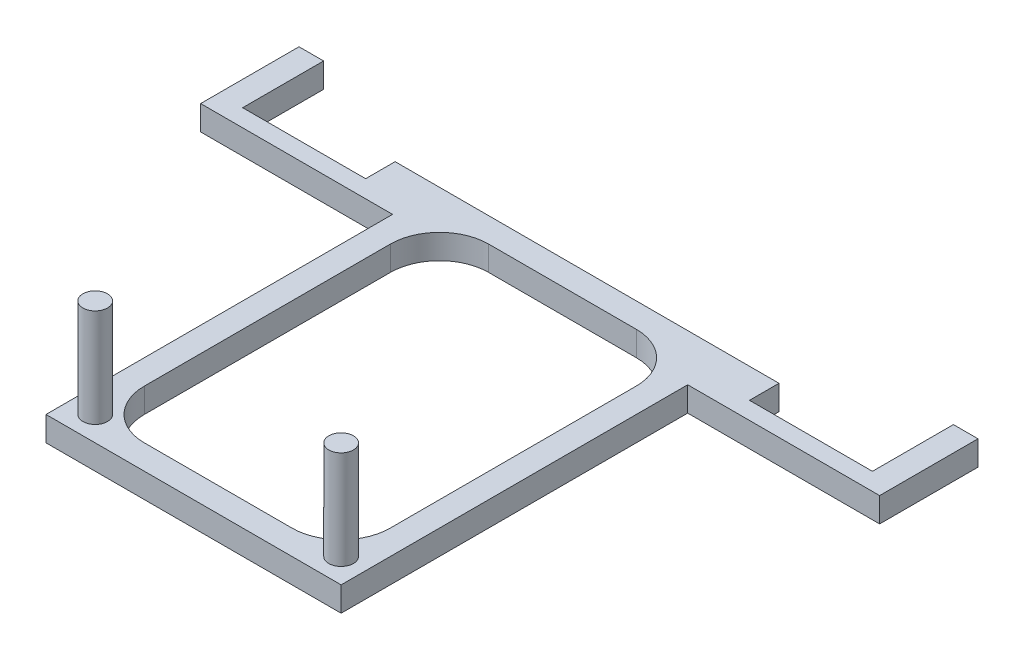
ISO-10303-21;
HEADER;
FILE_DESCRIPTION(('STEP AP214'),'2;1');
FILE_NAME('part.step','',(''),(''),'','','');
FILE_SCHEMA(('AUTOMOTIVE_DESIGN { 1 0 10303 214 1 1 1 1 }'));
ENDSEC;
DATA;
#1=APPLICATION_CONTEXT('core data for automotive mechanical design processes');
#2=APPLICATION_PROTOCOL_DEFINITION('international standard','automotive_design',2000,#1);
#3=PRODUCT_CONTEXT('',#1,'mechanical');
#4=PRODUCT('Part','Part','',(#3));
#5=PRODUCT_RELATED_PRODUCT_CATEGORY('part','',(#4));
#6=PRODUCT_DEFINITION_FORMATION('','',#4);
#7=PRODUCT_DEFINITION_CONTEXT('part definition',#1,'design');
#8=PRODUCT_DEFINITION('design','',#6,#7);
#9=PRODUCT_DEFINITION_SHAPE('','',#8);
#10=(LENGTH_UNIT() NAMED_UNIT(*) SI_UNIT(.MILLI.,.METRE.));
#11=(NAMED_UNIT(*) PLANE_ANGLE_UNIT() SI_UNIT($,.RADIAN.));
#12=(NAMED_UNIT(*) SI_UNIT($,.STERADIAN.) SOLID_ANGLE_UNIT());
#13=UNCERTAINTY_MEASURE_WITH_UNIT(LENGTH_MEASURE(1.E-05),#10,'distance_accuracy_value','');
#14=(GEOMETRIC_REPRESENTATION_CONTEXT(3) GLOBAL_UNCERTAINTY_ASSIGNED_CONTEXT((#13)) GLOBAL_UNIT_ASSIGNED_CONTEXT((#10,
#11,#12)) REPRESENTATION_CONTEXT('',''));
#15=CARTESIAN_POINT('',(0.,0.,0.));
#16=DIRECTION('',(0.,0.,1.));
#17=DIRECTION('',(1.,0.,0.));
#18=AXIS2_PLACEMENT_3D('',#15,#16,#17);
#19=CARTESIAN_POINT('',(0.,1.27,0.));
#20=DIRECTION('',(0.,-1.,0.));
#21=DIRECTION('',(0.,0.,-1.));
#22=AXIS2_PLACEMENT_3D('',#19,#20,#21);
#23=PLANE('',#22);
#24=DIRECTION('',(-1.,0.,0.));
#25=VECTOR('',#24,1.);
#26=CARTESIAN_POINT('',(-9.91107588120617,1.27,-10.16));
#27=LINE('',#26,#25);
#28=CARTESIAN_POINT('',(9.91107588120618,1.27,-10.16));
#29=VERTEX_POINT('',#28);
#30=CARTESIAN_POINT('',(-9.91107588120617,1.27,-10.16));
#31=VERTEX_POINT('',#30);
#32=EDGE_CURVE('E273',#29,#31,#27,.T.);
#33=ORIENTED_EDGE('',*,*,#32,.T.);
#34=DIRECTION('',(0.,0.,1.));
#35=VECTOR('',#34,1.);
#36=CARTESIAN_POINT('',(-9.91107588120617,1.27,-10.16));
#37=LINE('',#36,#35);
#38=CARTESIAN_POINT('',(-9.91107588120617,1.27,-8.636));
#39=VERTEX_POINT('',#38);
#40=EDGE_CURVE('E276',#31,#39,#37,.T.);
#41=ORIENTED_EDGE('',*,*,#40,.T.);
#42=DIRECTION('',(-1.,0.,0.));
#43=VECTOR('',#42,1.);
#44=CARTESIAN_POINT('',(-16.2610758812062,1.27,-8.636));
#45=LINE('',#44,#43);
#46=CARTESIAN_POINT('',(-16.2610758812062,1.27,-8.636));
#47=VERTEX_POINT('',#46);
#48=EDGE_CURVE('E279',#39,#47,#45,.T.);
#49=ORIENTED_EDGE('',*,*,#48,.T.);
#50=DIRECTION('',(0.,0.,-1.));
#51=VECTOR('',#50,1.);
#52=CARTESIAN_POINT('',(-16.2610758812062,1.27,-10.16));
#53=LINE('',#52,#51);
#54=CARTESIAN_POINT('',(-16.2610758812062,1.27,-12.8165032781127));
#55=VERTEX_POINT('',#54);
#56=EDGE_CURVE('E281',#47,#55,#53,.T.);
#57=ORIENTED_EDGE('',*,*,#56,.T.);
#58=DIRECTION('',(-1.,0.,0.));
#59=VECTOR('',#58,1.);
#60=CARTESIAN_POINT('',(-17.5310758812062,1.27,-12.8165032781127));
#61=LINE('',#60,#59);
#62=CARTESIAN_POINT('',(-17.5310758812062,1.27,-12.8165032781127));
#63=VERTEX_POINT('',#62);
#64=EDGE_CURVE('E283',#55,#63,#61,.T.);
#65=ORIENTED_EDGE('',*,*,#64,.T.);
#66=DIRECTION('',(0.,0.,1.));
#67=VECTOR('',#66,1.);
#68=CARTESIAN_POINT('',(-17.5310758812062,1.27,-10.2765032781127));
#69=LINE('',#68,#67);
#70=CARTESIAN_POINT('',(-17.5310758812062,1.27,-7.73650327811265));
#71=VERTEX_POINT('',#70);
#72=EDGE_CURVE('E285',#63,#71,#69,.T.);
#73=ORIENTED_EDGE('',*,*,#72,.T.);
#74=DIRECTION('',(1.,0.,0.));
#75=VECTOR('',#74,1.);
#76=CARTESIAN_POINT('',(-17.5310758812062,1.27,-7.73650327811265));
#77=LINE('',#76,#75);
#78=CARTESIAN_POINT('',(-7.62,1.27,-7.73650327811265));
#79=VERTEX_POINT('',#78);
#80=EDGE_CURVE('E287',#71,#79,#77,.T.);
#81=ORIENTED_EDGE('',*,*,#80,.T.);
#82=DIRECTION('',(0.,0.,1.));
#83=VECTOR('',#82,1.);
#84=CARTESIAN_POINT('',(-7.62,1.27,-7.73650327811265));
#85=LINE('',#84,#83);
#86=CARTESIAN_POINT('',(-7.62,1.27,10.16));
#87=VERTEX_POINT('',#86);
#88=EDGE_CURVE('E289',#79,#87,#85,.T.);
#89=ORIENTED_EDGE('',*,*,#88,.T.);
#90=DIRECTION('',(1.,0.,0.));
#91=VECTOR('',#90,1.);
#92=CARTESIAN_POINT('',(7.62,1.27,10.16));
#93=LINE('',#92,#91);
#94=CARTESIAN_POINT('',(7.62,1.27,10.16));
#95=VERTEX_POINT('',#94);
#96=EDGE_CURVE('E291',#87,#95,#93,.T.);
#97=ORIENTED_EDGE('',*,*,#96,.T.);
#98=DIRECTION('',(0.,0.,-1.));
#99=VECTOR('',#98,1.);
#100=CARTESIAN_POINT('',(7.62000000000001,1.27,-7.73650327811265));
#101=LINE('',#100,#99);
#102=CARTESIAN_POINT('',(7.62000000000001,1.27,-7.73650327811265));
#103=VERTEX_POINT('',#102);
#104=EDGE_CURVE('E293',#95,#103,#101,.T.);
#105=ORIENTED_EDGE('',*,*,#104,.T.);
#106=DIRECTION('',(1.,0.,0.));
#107=VECTOR('',#106,1.);
#108=CARTESIAN_POINT('',(17.5310758812062,1.27,-7.73650327811265));
#109=LINE('',#108,#107);
#110=CARTESIAN_POINT('',(17.5310758812062,1.27,-7.73650327811265));
#111=VERTEX_POINT('',#110);
#112=EDGE_CURVE('E295',#103,#111,#109,.T.);
#113=ORIENTED_EDGE('',*,*,#112,.T.);
#114=DIRECTION('',(0.,0.,-1.));
#115=VECTOR('',#114,1.);
#116=CARTESIAN_POINT('',(17.5310758812062,1.27,-10.2765032781127));
#117=LINE('',#116,#115);
#118=CARTESIAN_POINT('',(17.5310758812062,1.27,-12.8165032781127));
#119=VERTEX_POINT('',#118);
#120=EDGE_CURVE('E297',#111,#119,#117,.T.);
#121=ORIENTED_EDGE('',*,*,#120,.T.);
#122=DIRECTION('',(-1.,0.,0.));
#123=VECTOR('',#122,1.);
#124=CARTESIAN_POINT('',(17.5310758812062,1.27,-12.8165032781127));
#125=LINE('',#124,#123);
#126=CARTESIAN_POINT('',(16.2610758812062,1.27,-12.8165032781127));
#127=VERTEX_POINT('',#126);
#128=EDGE_CURVE('E299',#119,#127,#125,.T.);
#129=ORIENTED_EDGE('',*,*,#128,.T.);
#130=DIRECTION('',(0.,0.,1.));
#131=VECTOR('',#130,1.);
#132=CARTESIAN_POINT('',(16.2610758812062,1.27,-12.8165032781127));
#133=LINE('',#132,#131);
#134=CARTESIAN_POINT('',(16.2610758812062,1.27,-8.636));
#135=VERTEX_POINT('',#134);
#136=EDGE_CURVE('E301',#127,#135,#133,.T.);
#137=ORIENTED_EDGE('',*,*,#136,.T.);
#138=DIRECTION('',(-1.,0.,0.));
#139=VECTOR('',#138,1.);
#140=CARTESIAN_POINT('',(16.2610758812062,1.27,-8.636));
#141=LINE('',#140,#139);
#142=CARTESIAN_POINT('',(9.91107588120618,1.27,-8.636));
#143=VERTEX_POINT('',#142);
#144=EDGE_CURVE('E303',#135,#143,#141,.T.);
#145=ORIENTED_EDGE('',*,*,#144,.T.);
#146=DIRECTION('',(0.,0.,-1.));
#147=VECTOR('',#146,1.);
#148=CARTESIAN_POINT('',(9.91107588120618,1.27,-10.16));
#149=LINE('',#148,#147);
#150=EDGE_CURVE('E305',#143,#29,#149,.T.);
#151=ORIENTED_EDGE('',*,*,#150,.T.);
#152=EDGE_LOOP('',(#33,#41,#49,#57,#65,#73,#81,#89,#97,#105,#113,#121,#129,#137,#145,#151));
#153=FACE_BOUND('',#152,.T.);
#154=CARTESIAN_POINT('',(-6.35,1.27,8.89));
#155=DIRECTION('',(0.,-1.,0.));
#156=DIRECTION('',(0.,0.,-1.));
#157=AXIS2_PLACEMENT_3D('',#154,#155,#156);
#158=CIRCLE('',#157,0.635000000000001);
#159=CARTESIAN_POINT('',(-6.35,1.27,8.255));
#160=VERTEX_POINT('',#159);
#161=EDGE_CURVE('E266',#160,#160,#158,.F.);
#162=ORIENTED_EDGE('',*,*,#161,.F.);
#163=EDGE_LOOP('',(#162));
#164=FACE_BOUND('',#163,.T.);
#165=CARTESIAN_POINT('',(6.35,1.27,8.89));
#166=DIRECTION('',(0.,-1.,0.));
#167=DIRECTION('',(0.,0.,-1.));
#168=AXIS2_PLACEMENT_3D('',#165,#166,#167);
#169=CIRCLE('',#168,0.635000000000001);
#170=CARTESIAN_POINT('',(6.35,1.27,8.255));
#171=VERTEX_POINT('',#170);
#172=EDGE_CURVE('E201',#171,#171,#169,.F.);
#173=ORIENTED_EDGE('',*,*,#172,.F.);
#174=EDGE_LOOP('',(#173));
#175=FACE_BOUND('',#174,.T.);
#176=CARTESIAN_POINT('',(-3.81,1.27,6.35));
#177=DIRECTION('',(0.,-1.,0.));
#178=DIRECTION('',(0.,0.,-1.));
#179=AXIS2_PLACEMENT_3D('',#176,#177,#178);
#180=CIRCLE('',#179,2.54);
#181=CARTESIAN_POINT('',(-6.35,1.27,6.34999999999998));
#182=VERTEX_POINT('',#181);
#183=CARTESIAN_POINT('',(-3.80999999999998,1.27,8.89));
#184=VERTEX_POINT('',#183);
#185=EDGE_CURVE('E240',#182,#184,#180,.F.);
#186=ORIENTED_EDGE('',*,*,#185,.F.);
#187=DIRECTION('',(0.,0.,1.));
#188=VECTOR('',#187,1.);
#189=CARTESIAN_POINT('',(-6.35,1.27,0.));
#190=LINE('',#189,#188);
#191=CARTESIAN_POINT('',(-6.35,1.27,-6.34999999999998));
#192=VERTEX_POINT('',#191);
#193=EDGE_CURVE('E241',#192,#182,#190,.T.);
#194=ORIENTED_EDGE('',*,*,#193,.F.);
#195=CARTESIAN_POINT('',(-3.81,1.27,-6.35));
#196=DIRECTION('',(0.,-1.,0.));
#197=DIRECTION('',(0.,0.,-1.));
#198=AXIS2_PLACEMENT_3D('',#195,#196,#197);
#199=CIRCLE('',#198,2.54);
#200=CARTESIAN_POINT('',(-3.80999999999998,1.27,-8.89));
#201=VERTEX_POINT('',#200);
#202=EDGE_CURVE('E208',#201,#192,#199,.F.);
#203=ORIENTED_EDGE('',*,*,#202,.F.);
#204=DIRECTION('',(-1.,0.,0.));
#205=VECTOR('',#204,1.);
#206=CARTESIAN_POINT('',(0.,1.27,-8.89));
#207=LINE('',#206,#205);
#208=CARTESIAN_POINT('',(3.80999999999998,1.27,-8.89));
#209=VERTEX_POINT('',#208);
#210=EDGE_CURVE('E249',#209,#201,#207,.T.);
#211=ORIENTED_EDGE('',*,*,#210,.F.);
#212=CARTESIAN_POINT('',(3.81,1.27,-6.35));
#213=DIRECTION('',(0.,-1.,0.));
#214=DIRECTION('',(0.,0.,-1.));
#215=AXIS2_PLACEMENT_3D('',#212,#213,#214);
#216=CIRCLE('',#215,2.54);
#217=CARTESIAN_POINT('',(6.35,1.27,-6.34999999999998));
#218=VERTEX_POINT('',#217);
#219=EDGE_CURVE('E251',#218,#209,#216,.F.);
#220=ORIENTED_EDGE('',*,*,#219,.F.);
#221=DIRECTION('',(0.,0.,-1.));
#222=VECTOR('',#221,1.);
#223=CARTESIAN_POINT('',(6.35,1.27,0.));
#224=LINE('',#223,#222);
#225=CARTESIAN_POINT('',(6.35,1.27,6.34999999999998));
#226=VERTEX_POINT('',#225);
#227=EDGE_CURVE('E253',#226,#218,#224,.T.);
#228=ORIENTED_EDGE('',*,*,#227,.F.);
#229=CARTESIAN_POINT('',(3.81,1.27,6.35));
#230=DIRECTION('',(0.,-1.,0.));
#231=DIRECTION('',(0.,0.,-1.));
#232=AXIS2_PLACEMENT_3D('',#229,#230,#231);
#233=CIRCLE('',#232,2.54);
#234=CARTESIAN_POINT('',(3.80999999999998,1.27,8.89));
#235=VERTEX_POINT('',#234);
#236=EDGE_CURVE('E255',#235,#226,#233,.F.);
#237=ORIENTED_EDGE('',*,*,#236,.F.);
#238=DIRECTION('',(1.,0.,0.));
#239=VECTOR('',#238,1.);
#240=CARTESIAN_POINT('',(0.,1.27,8.89));
#241=LINE('',#240,#239);
#242=EDGE_CURVE('E257',#184,#235,#241,.T.);
#243=ORIENTED_EDGE('',*,*,#242,.F.);
#244=EDGE_LOOP('',(#186,#194,#203,#211,#220,#228,#237,#243));
#245=FACE_BOUND('',#244,.T.);
#246=ADVANCED_FACE('F38',(#153,#164,#175,#245),#23,.F.);
#247=CARTESIAN_POINT('',(0.,0.,0.));
#248=DIRECTION('',(0.,-1.,0.));
#249=DIRECTION('',(0.,0.,-1.));
#250=AXIS2_PLACEMENT_3D('',#247,#248,#249);
#251=PLANE('',#250);
#252=DIRECTION('',(0.,0.,1.));
#253=VECTOR('',#252,1.);
#254=CARTESIAN_POINT('',(-9.91107588120617,0.,-10.16));
#255=LINE('',#254,#253);
#256=CARTESIAN_POINT('',(-9.91107588120617,0.,-10.16));
#257=VERTEX_POINT('',#256);
#258=CARTESIAN_POINT('',(-9.91107588120617,0.,-8.636));
#259=VERTEX_POINT('',#258);
#260=EDGE_CURVE('E269',#257,#259,#255,.T.);
#261=ORIENTED_EDGE('',*,*,#260,.F.);
#262=DIRECTION('',(-1.,0.,0.));
#263=VECTOR('',#262,1.);
#264=CARTESIAN_POINT('',(7.62,0.,-10.16));
#265=LINE('',#264,#263);
#266=CARTESIAN_POINT('',(9.91107588120618,0.,-10.16));
#267=VERTEX_POINT('',#266);
#268=EDGE_CURVE('E277',#267,#257,#265,.T.);
#269=ORIENTED_EDGE('',*,*,#268,.F.);
#270=DIRECTION('',(0.,0.,-1.));
#271=VECTOR('',#270,1.);
#272=CARTESIAN_POINT('',(9.91107588120618,0.,-10.16));
#273=LINE('',#272,#271);
#274=CARTESIAN_POINT('',(9.91107588120618,0.,-8.636));
#275=VERTEX_POINT('',#274);
#276=EDGE_CURVE('E340',#275,#267,#273,.T.);
#277=ORIENTED_EDGE('',*,*,#276,.F.);
#278=DIRECTION('',(-1.,0.,0.));
#279=VECTOR('',#278,1.);
#280=CARTESIAN_POINT('',(16.2610758812062,0.,-8.636));
#281=LINE('',#280,#279);
#282=CARTESIAN_POINT('',(16.2610758812062,0.,-8.636));
#283=VERTEX_POINT('',#282);
#284=EDGE_CURVE('E338',#283,#275,#281,.T.);
#285=ORIENTED_EDGE('',*,*,#284,.F.);
#286=DIRECTION('',(0.,0.,1.));
#287=VECTOR('',#286,1.);
#288=CARTESIAN_POINT('',(16.2610758812062,0.,-10.16));
#289=LINE('',#288,#287);
#290=CARTESIAN_POINT('',(16.2610758812062,0.,-12.8165032781127));
#291=VERTEX_POINT('',#290);
#292=EDGE_CURVE('E336',#291,#283,#289,.T.);
#293=ORIENTED_EDGE('',*,*,#292,.F.);
#294=DIRECTION('',(-1.,0.,0.));
#295=VECTOR('',#294,1.);
#296=CARTESIAN_POINT('',(17.5310758812062,0.,-12.8165032781127));
#297=LINE('',#296,#295);
#298=CARTESIAN_POINT('',(17.5310758812062,0.,-12.8165032781127));
#299=VERTEX_POINT('',#298);
#300=EDGE_CURVE('E333',#299,#291,#297,.T.);
#301=ORIENTED_EDGE('',*,*,#300,.F.);
#302=DIRECTION('',(0.,0.,-1.));
#303=VECTOR('',#302,1.);
#304=CARTESIAN_POINT('',(17.5310758812062,0.,-10.2765032781127));
#305=LINE('',#304,#303);
#306=CARTESIAN_POINT('',(17.5310758812062,0.,-7.73650327811265));
#307=VERTEX_POINT('',#306);
#308=EDGE_CURVE('E331',#307,#299,#305,.T.);
#309=ORIENTED_EDGE('',*,*,#308,.F.);
#310=DIRECTION('',(1.,0.,0.));
#311=VECTOR('',#310,1.);
#312=CARTESIAN_POINT('',(17.5310758812062,0.,-7.73650327811265));
#313=LINE('',#312,#311);
#314=CARTESIAN_POINT('',(7.62000000000001,0.,-7.73650327811265));
#315=VERTEX_POINT('',#314);
#316=EDGE_CURVE('E328',#315,#307,#313,.T.);
#317=ORIENTED_EDGE('',*,*,#316,.F.);
#318=DIRECTION('',(0.,0.,-1.));
#319=VECTOR('',#318,1.);
#320=CARTESIAN_POINT('',(7.62000000000001,0.,-7.73650327811265));
#321=LINE('',#320,#319);
#322=CARTESIAN_POINT('',(7.62,0.,10.16));
#323=VERTEX_POINT('',#322);
#324=EDGE_CURVE('E326',#323,#315,#321,.T.);
#325=ORIENTED_EDGE('',*,*,#324,.F.);
#326=DIRECTION('',(1.,0.,0.));
#327=VECTOR('',#326,1.);
#328=CARTESIAN_POINT('',(7.62,0.,10.16));
#329=LINE('',#328,#327);
#330=CARTESIAN_POINT('',(-7.62,0.,10.16));
#331=VERTEX_POINT('',#330);
#332=EDGE_CURVE('E324',#331,#323,#329,.T.);
#333=ORIENTED_EDGE('',*,*,#332,.F.);
#334=DIRECTION('',(0.,0.,1.));
#335=VECTOR('',#334,1.);
#336=CARTESIAN_POINT('',(-7.62,0.,-7.73650327811265));
#337=LINE('',#336,#335);
#338=CARTESIAN_POINT('',(-7.62,0.,-7.73650327811265));
#339=VERTEX_POINT('',#338);
#340=EDGE_CURVE('E322',#339,#331,#337,.T.);
#341=ORIENTED_EDGE('',*,*,#340,.F.);
#342=DIRECTION('',(1.,0.,0.));
#343=VECTOR('',#342,1.);
#344=CARTESIAN_POINT('',(-17.5310758812062,0.,-7.73650327811265));
#345=LINE('',#344,#343);
#346=CARTESIAN_POINT('',(-17.5310758812062,0.,-7.73650327811265));
#347=VERTEX_POINT('',#346);
#348=EDGE_CURVE('E320',#347,#339,#345,.T.);
#349=ORIENTED_EDGE('',*,*,#348,.F.);
#350=DIRECTION('',(0.,0.,1.));
#351=VECTOR('',#350,1.);
#352=CARTESIAN_POINT('',(-17.5310758812062,0.,-10.2765032781127));
#353=LINE('',#352,#351);
#354=CARTESIAN_POINT('',(-17.5310758812062,0.,-12.8165032781127));
#355=VERTEX_POINT('',#354);
#356=EDGE_CURVE('E318',#355,#347,#353,.T.);
#357=ORIENTED_EDGE('',*,*,#356,.F.);
#358=DIRECTION('',(-1.,0.,0.));
#359=VECTOR('',#358,1.);
#360=CARTESIAN_POINT('',(-17.5310758812062,0.,-12.8165032781127));
#361=LINE('',#360,#359);
#362=CARTESIAN_POINT('',(-16.2610758812062,0.,-12.8165032781127));
#363=VERTEX_POINT('',#362);
#364=EDGE_CURVE('E315',#363,#355,#361,.T.);
#365=ORIENTED_EDGE('',*,*,#364,.F.);
#366=DIRECTION('',(0.,0.,-1.));
#367=VECTOR('',#366,1.);
#368=CARTESIAN_POINT('',(-16.2610758812062,0.,-12.8165032781127));
#369=LINE('',#368,#367);
#370=CARTESIAN_POINT('',(-16.2610758812062,0.,-8.636));
#371=VERTEX_POINT('',#370);
#372=EDGE_CURVE('E313',#371,#363,#369,.T.);
#373=ORIENTED_EDGE('',*,*,#372,.F.);
#374=DIRECTION('',(-1.,0.,0.));
#375=VECTOR('',#374,1.);
#376=CARTESIAN_POINT('',(-16.2610758812062,0.,-8.636));
#377=LINE('',#376,#375);
#378=EDGE_CURVE('E310',#259,#371,#377,.T.);
#379=ORIENTED_EDGE('',*,*,#378,.F.);
#380=EDGE_LOOP('',(#261,#269,#277,#285,#293,#301,#309,#317,#325,#333,#341,#349,#357,#365,#373,#379));
#381=FACE_BOUND('',#380,.T.);
#382=DIRECTION('',(0.,0.,1.));
#383=VECTOR('',#382,1.);
#384=CARTESIAN_POINT('',(-6.35,0.,0.));
#385=LINE('',#384,#383);
#386=CARTESIAN_POINT('',(-6.35,0.,-6.34999999999998));
#387=VERTEX_POINT('',#386);
#388=CARTESIAN_POINT('',(-6.35,0.,6.34999999999998));
#389=VERTEX_POINT('',#388);
#390=EDGE_CURVE('E196',#387,#389,#385,.T.);
#391=ORIENTED_EDGE('',*,*,#390,.T.);
#392=CARTESIAN_POINT('',(-3.81,0.,6.35));
#393=DIRECTION('',(0.,-1.,0.));
#394=DIRECTION('',(0.,0.,-1.));
#395=AXIS2_PLACEMENT_3D('',#392,#393,#394);
#396=CIRCLE('',#395,2.54);
#397=CARTESIAN_POINT('',(-3.80999999999998,0.,8.89));
#398=VERTEX_POINT('',#397);
#399=EDGE_CURVE('E11',#389,#398,#396,.F.);
#400=ORIENTED_EDGE('',*,*,#399,.T.);
#401=DIRECTION('',(1.,0.,0.));
#402=VECTOR('',#401,1.);
#403=CARTESIAN_POINT('',(0.,0.,8.89));
#404=LINE('',#403,#402);
#405=CARTESIAN_POINT('',(3.80999999999998,0.,8.89));
#406=VERTEX_POINT('',#405);
#407=EDGE_CURVE('E46',#398,#406,#404,.T.);
#408=ORIENTED_EDGE('',*,*,#407,.T.);
#409=CARTESIAN_POINT('',(3.81,0.,6.35));
#410=DIRECTION('',(0.,-1.,0.));
#411=DIRECTION('',(0.,0.,-1.));
#412=AXIS2_PLACEMENT_3D('',#409,#410,#411);
#413=CIRCLE('',#412,2.54);
#414=CARTESIAN_POINT('',(6.35,0.,6.34999999999998));
#415=VERTEX_POINT('',#414);
#416=EDGE_CURVE('E225',#406,#415,#413,.F.);
#417=ORIENTED_EDGE('',*,*,#416,.T.);
#418=DIRECTION('',(0.,0.,-1.));
#419=VECTOR('',#418,1.);
#420=CARTESIAN_POINT('',(6.35,0.,0.));
#421=LINE('',#420,#419);
#422=CARTESIAN_POINT('',(6.35,0.,-6.34999999999998));
#423=VERTEX_POINT('',#422);
#424=EDGE_CURVE('E222',#415,#423,#421,.T.);
#425=ORIENTED_EDGE('',*,*,#424,.T.);
#426=CARTESIAN_POINT('',(3.81,0.,-6.35));
#427=DIRECTION('',(0.,-1.,0.));
#428=DIRECTION('',(0.,0.,-1.));
#429=AXIS2_PLACEMENT_3D('',#426,#427,#428);
#430=CIRCLE('',#429,2.54);
#431=CARTESIAN_POINT('',(3.80999999999998,0.,-8.89));
#432=VERTEX_POINT('',#431);
#433=EDGE_CURVE('E217',#423,#432,#430,.F.);
#434=ORIENTED_EDGE('',*,*,#433,.T.);
#435=DIRECTION('',(-1.,0.,0.));
#436=VECTOR('',#435,1.);
#437=CARTESIAN_POINT('',(0.,0.,-8.89));
#438=LINE('',#437,#436);
#439=CARTESIAN_POINT('',(-3.80999999999998,0.,-8.89));
#440=VERTEX_POINT('',#439);
#441=EDGE_CURVE('E215',#432,#440,#438,.T.);
#442=ORIENTED_EDGE('',*,*,#441,.T.);
#443=CARTESIAN_POINT('',(-3.81,0.,-6.35));
#444=DIRECTION('',(0.,-1.,0.));
#445=DIRECTION('',(0.,0.,-1.));
#446=AXIS2_PLACEMENT_3D('',#443,#444,#445);
#447=CIRCLE('',#446,2.54);
#448=EDGE_CURVE('E200',#440,#387,#447,.F.);
#449=ORIENTED_EDGE('',*,*,#448,.T.);
#450=EDGE_LOOP('',(#391,#400,#408,#417,#425,#434,#442,#449));
#451=FACE_BOUND('',#450,.T.);
#452=ADVANCED_FACE('F213',(#381,#451),#251,.T.);
#453=CARTESIAN_POINT('',(-9.91107588120617,1.27,-10.16));
#454=DIRECTION('',(1.,0.,0.));
#455=DIRECTION('',(0.,0.,-1.));
#456=AXIS2_PLACEMENT_3D('',#453,#454,#455);
#457=PLANE('',#456);
#458=ORIENTED_EDGE('',*,*,#260,.T.);
#459=DIRECTION('',(0.,-1.,0.));
#460=VECTOR('',#459,1.);
#461=CARTESIAN_POINT('',(-9.91107588120617,1.27,-8.636));
#462=LINE('',#461,#460);
#463=EDGE_CURVE('E385',#39,#259,#462,.T.);
#464=ORIENTED_EDGE('',*,*,#463,.F.);
#465=ORIENTED_EDGE('',*,*,#40,.F.);
#466=DIRECTION('',(0.,-1.,0.));
#467=VECTOR('',#466,1.);
#468=CARTESIAN_POINT('',(-9.91107588120617,1.27,-10.16));
#469=LINE('',#468,#467);
#470=EDGE_CURVE('E272',#31,#257,#469,.T.);
#471=ORIENTED_EDGE('',*,*,#470,.T.);
#472=EDGE_LOOP('',(#458,#464,#465,#471));
#473=FACE_BOUND('',#472,.T.);
#474=ADVANCED_FACE('F40',(#473),#457,.F.);
#475=CARTESIAN_POINT('',(-16.2610758812062,1.27,-8.636));
#476=DIRECTION('',(0.,0.,1.));
#477=DIRECTION('',(1.,0.,0.));
#478=AXIS2_PLACEMENT_3D('',#475,#476,#477);
#479=PLANE('',#478);
#480=ORIENTED_EDGE('',*,*,#378,.T.);
#481=DIRECTION('',(0.,-1.,0.));
#482=VECTOR('',#481,1.);
#483=CARTESIAN_POINT('',(-16.2610758812062,1.27,-8.636));
#484=LINE('',#483,#482);
#485=EDGE_CURVE('E382',#47,#371,#484,.T.);
#486=ORIENTED_EDGE('',*,*,#485,.F.);
#487=ORIENTED_EDGE('',*,*,#48,.F.);
#488=ORIENTED_EDGE('',*,*,#463,.T.);
#489=EDGE_LOOP('',(#480,#486,#487,#488));
#490=FACE_BOUND('',#489,.T.);
#491=ADVANCED_FACE('F401',(#490),#479,.F.);
#492=CARTESIAN_POINT('',(-16.2610758812062,1.27,-12.8165032781127));
#493=DIRECTION('',(-1.,0.,0.));
#494=DIRECTION('',(0.,0.,1.));
#495=AXIS2_PLACEMENT_3D('',#492,#493,#494);
#496=PLANE('',#495);
#497=ORIENTED_EDGE('',*,*,#372,.T.);
#498=DIRECTION('',(0.,-1.,0.));
#499=VECTOR('',#498,1.);
#500=CARTESIAN_POINT('',(-16.2610758812062,1.27,-12.8165032781127));
#501=LINE('',#500,#499);
#502=EDGE_CURVE('E379',#55,#363,#501,.T.);
#503=ORIENTED_EDGE('',*,*,#502,.F.);
#504=ORIENTED_EDGE('',*,*,#56,.F.);
#505=ORIENTED_EDGE('',*,*,#485,.T.);
#506=EDGE_LOOP('',(#497,#503,#504,#505));
#507=FACE_BOUND('',#506,.T.);
#508=ADVANCED_FACE('F405',(#507),#496,.F.);
#509=CARTESIAN_POINT('',(-17.5310758812062,1.27,-12.8165032781127));
#510=DIRECTION('',(0.,0.,1.));
#511=DIRECTION('',(1.,0.,0.));
#512=AXIS2_PLACEMENT_3D('',#509,#510,#511);
#513=PLANE('',#512);
#514=ORIENTED_EDGE('',*,*,#364,.T.);
#515=DIRECTION('',(0.,-1.,0.));
#516=VECTOR('',#515,1.);
#517=CARTESIAN_POINT('',(-17.5310758812062,1.27,-12.8165032781127));
#518=LINE('',#517,#516);
#519=EDGE_CURVE('E376',#63,#355,#518,.T.);
#520=ORIENTED_EDGE('',*,*,#519,.F.);
#521=ORIENTED_EDGE('',*,*,#64,.F.);
#522=ORIENTED_EDGE('',*,*,#502,.T.);
#523=EDGE_LOOP('',(#514,#520,#521,#522));
#524=FACE_BOUND('',#523,.T.);
#525=ADVANCED_FACE('F460',(#524),#513,.F.);
#526=CARTESIAN_POINT('',(-17.5310758812062,1.27,-10.2765032781127));
#527=DIRECTION('',(1.,0.,0.));
#528=DIRECTION('',(0.,0.,-1.));
#529=AXIS2_PLACEMENT_3D('',#526,#527,#528);
#530=PLANE('',#529);
#531=ORIENTED_EDGE('',*,*,#356,.T.);
#532=DIRECTION('',(0.,-1.,0.));
#533=VECTOR('',#532,1.);
#534=CARTESIAN_POINT('',(-17.5310758812062,1.27,-7.73650327811265));
#535=LINE('',#534,#533);
#536=EDGE_CURVE('E373',#71,#347,#535,.T.);
#537=ORIENTED_EDGE('',*,*,#536,.F.);
#538=ORIENTED_EDGE('',*,*,#72,.F.);
#539=ORIENTED_EDGE('',*,*,#519,.T.);
#540=EDGE_LOOP('',(#531,#537,#538,#539));
#541=FACE_BOUND('',#540,.T.);
#542=ADVANCED_FACE('F462',(#541),#530,.F.);
#543=CARTESIAN_POINT('',(-17.5310758812062,1.27,-7.73650327811265));
#544=DIRECTION('',(0.,0.,-1.));
#545=DIRECTION('',(-1.,0.,0.));
#546=AXIS2_PLACEMENT_3D('',#543,#544,#545);
#547=PLANE('',#546);
#548=ORIENTED_EDGE('',*,*,#348,.T.);
#549=DIRECTION('',(0.,-1.,0.));
#550=VECTOR('',#549,1.);
#551=CARTESIAN_POINT('',(-7.62,1.27,-7.73650327811265));
#552=LINE('',#551,#550);
#553=EDGE_CURVE('E370',#79,#339,#552,.T.);
#554=ORIENTED_EDGE('',*,*,#553,.F.);
#555=ORIENTED_EDGE('',*,*,#80,.F.);
#556=ORIENTED_EDGE('',*,*,#536,.T.);
#557=EDGE_LOOP('',(#548,#554,#555,#556));
#558=FACE_BOUND('',#557,.T.);
#559=ADVANCED_FACE('F456',(#558),#547,.F.);
#560=CARTESIAN_POINT('',(-7.62,1.27,-7.73650327811265));
#561=DIRECTION('',(1.,0.,0.));
#562=DIRECTION('',(0.,0.,-1.));
#563=AXIS2_PLACEMENT_3D('',#560,#561,#562);
#564=PLANE('',#563);
#565=ORIENTED_EDGE('',*,*,#340,.T.);
#566=DIRECTION('',(0.,-1.,0.));
#567=VECTOR('',#566,1.);
#568=CARTESIAN_POINT('',(-7.62,1.27,10.16));
#569=LINE('',#568,#567);
#570=EDGE_CURVE('E367',#87,#331,#569,.T.);
#571=ORIENTED_EDGE('',*,*,#570,.F.);
#572=ORIENTED_EDGE('',*,*,#88,.F.);
#573=ORIENTED_EDGE('',*,*,#553,.T.);
#574=EDGE_LOOP('',(#565,#571,#572,#573));
#575=FACE_BOUND('',#574,.T.);
#576=ADVANCED_FACE('F452',(#575),#564,.F.);
#577=CARTESIAN_POINT('',(7.62,1.27,10.16));
#578=DIRECTION('',(0.,0.,-1.));
#579=DIRECTION('',(-1.,0.,0.));
#580=AXIS2_PLACEMENT_3D('',#577,#578,#579);
#581=PLANE('',#580);
#582=ORIENTED_EDGE('',*,*,#332,.T.);
#583=DIRECTION('',(0.,-1.,0.));
#584=VECTOR('',#583,1.);
#585=CARTESIAN_POINT('',(7.62,1.27,10.16));
#586=LINE('',#585,#584);
#587=EDGE_CURVE('E364',#95,#323,#586,.T.);
#588=ORIENTED_EDGE('',*,*,#587,.F.);
#589=ORIENTED_EDGE('',*,*,#96,.F.);
#590=ORIENTED_EDGE('',*,*,#570,.T.);
#591=EDGE_LOOP('',(#582,#588,#589,#590));
#592=FACE_BOUND('',#591,.T.);
#593=ADVANCED_FACE('F448',(#592),#581,.F.);
#594=CARTESIAN_POINT('',(7.62000000000001,1.27,-7.73650327811265));
#595=DIRECTION('',(-1.,0.,0.));
#596=DIRECTION('',(0.,0.,1.));
#597=AXIS2_PLACEMENT_3D('',#594,#595,#596);
#598=PLANE('',#597);
#599=ORIENTED_EDGE('',*,*,#324,.T.);
#600=DIRECTION('',(0.,-1.,0.));
#601=VECTOR('',#600,1.);
#602=CARTESIAN_POINT('',(7.62000000000001,1.27,-7.73650327811265));
#603=LINE('',#602,#601);
#604=EDGE_CURVE('E361',#103,#315,#603,.T.);
#605=ORIENTED_EDGE('',*,*,#604,.F.);
#606=ORIENTED_EDGE('',*,*,#104,.F.);
#607=ORIENTED_EDGE('',*,*,#587,.T.);
#608=EDGE_LOOP('',(#599,#605,#606,#607));
#609=FACE_BOUND('',#608,.T.);
#610=ADVANCED_FACE('F443',(#609),#598,.F.);
#611=CARTESIAN_POINT('',(17.5310758812062,1.27,-7.73650327811265));
#612=DIRECTION('',(0.,0.,-1.));
#613=DIRECTION('',(-1.,0.,0.));
#614=AXIS2_PLACEMENT_3D('',#611,#612,#613);
#615=PLANE('',#614);
#616=ORIENTED_EDGE('',*,*,#316,.T.);
#617=DIRECTION('',(0.,-1.,0.));
#618=VECTOR('',#617,1.);
#619=CARTESIAN_POINT('',(17.5310758812062,1.27,-7.73650327811265));
#620=LINE('',#619,#618);
#621=EDGE_CURVE('E358',#111,#307,#620,.T.);
#622=ORIENTED_EDGE('',*,*,#621,.F.);
#623=ORIENTED_EDGE('',*,*,#112,.F.);
#624=ORIENTED_EDGE('',*,*,#604,.T.);
#625=EDGE_LOOP('',(#616,#622,#623,#624));
#626=FACE_BOUND('',#625,.T.);
#627=ADVANCED_FACE('F434',(#626),#615,.F.);
#628=CARTESIAN_POINT('',(17.5310758812062,1.27,-10.2765032781127));
#629=DIRECTION('',(-1.,0.,0.));
#630=DIRECTION('',(0.,0.,1.));
#631=AXIS2_PLACEMENT_3D('',#628,#629,#630);
#632=PLANE('',#631);
#633=ORIENTED_EDGE('',*,*,#308,.T.);
#634=DIRECTION('',(0.,-1.,0.));
#635=VECTOR('',#634,1.);
#636=CARTESIAN_POINT('',(17.5310758812062,1.27,-12.8165032781127));
#637=LINE('',#636,#635);
#638=EDGE_CURVE('E355',#119,#299,#637,.T.);
#639=ORIENTED_EDGE('',*,*,#638,.F.);
#640=ORIENTED_EDGE('',*,*,#120,.F.);
#641=ORIENTED_EDGE('',*,*,#621,.T.);
#642=EDGE_LOOP('',(#633,#639,#640,#641));
#643=FACE_BOUND('',#642,.T.);
#644=ADVANCED_FACE('F438',(#643),#632,.F.);
#645=CARTESIAN_POINT('',(17.5310758812062,1.27,-12.8165032781127));
#646=DIRECTION('',(0.,0.,1.));
#647=DIRECTION('',(1.,0.,0.));
#648=AXIS2_PLACEMENT_3D('',#645,#646,#647);
#649=PLANE('',#648);
#650=ORIENTED_EDGE('',*,*,#300,.T.);
#651=DIRECTION('',(0.,-1.,0.));
#652=VECTOR('',#651,1.);
#653=CARTESIAN_POINT('',(16.2610758812062,1.27,-12.8165032781127));
#654=LINE('',#653,#652);
#655=EDGE_CURVE('E352',#127,#291,#654,.T.);
#656=ORIENTED_EDGE('',*,*,#655,.F.);
#657=ORIENTED_EDGE('',*,*,#128,.F.);
#658=ORIENTED_EDGE('',*,*,#638,.T.);
#659=EDGE_LOOP('',(#650,#656,#657,#658));
#660=FACE_BOUND('',#659,.T.);
#661=ADVANCED_FACE('F427',(#660),#649,.F.);
#662=CARTESIAN_POINT('',(16.2610758812062,1.27,-10.16));
#663=DIRECTION('',(1.,0.,0.));
#664=DIRECTION('',(0.,0.,-1.));
#665=AXIS2_PLACEMENT_3D('',#662,#663,#664);
#666=PLANE('',#665);
#667=ORIENTED_EDGE('',*,*,#292,.T.);
#668=DIRECTION('',(0.,-1.,0.));
#669=VECTOR('',#668,1.);
#670=CARTESIAN_POINT('',(16.2610758812062,1.27,-8.636));
#671=LINE('',#670,#669);
#672=EDGE_CURVE('E349',#135,#283,#671,.T.);
#673=ORIENTED_EDGE('',*,*,#672,.F.);
#674=ORIENTED_EDGE('',*,*,#136,.F.);
#675=ORIENTED_EDGE('',*,*,#655,.T.);
#676=EDGE_LOOP('',(#667,#673,#674,#675));
#677=FACE_BOUND('',#676,.T.);
#678=ADVANCED_FACE('F423',(#677),#666,.F.);
#679=CARTESIAN_POINT('',(16.2610758812062,1.27,-8.636));
#680=DIRECTION('',(0.,0.,1.));
#681=DIRECTION('',(1.,0.,0.));
#682=AXIS2_PLACEMENT_3D('',#679,#680,#681);
#683=PLANE('',#682);
#684=ORIENTED_EDGE('',*,*,#284,.T.);
#685=DIRECTION('',(0.,-1.,0.));
#686=VECTOR('',#685,1.);
#687=CARTESIAN_POINT('',(9.91107588120618,1.27,-8.636));
#688=LINE('',#687,#686);
#689=EDGE_CURVE('E346',#143,#275,#688,.T.);
#690=ORIENTED_EDGE('',*,*,#689,.F.);
#691=ORIENTED_EDGE('',*,*,#144,.F.);
#692=ORIENTED_EDGE('',*,*,#672,.T.);
#693=EDGE_LOOP('',(#684,#690,#691,#692));
#694=FACE_BOUND('',#693,.T.);
#695=ADVANCED_FACE('F419',(#694),#683,.F.);
#696=CARTESIAN_POINT('',(9.91107588120618,1.27,-10.16));
#697=DIRECTION('',(-1.,0.,0.));
#698=DIRECTION('',(0.,0.,1.));
#699=AXIS2_PLACEMENT_3D('',#696,#697,#698);
#700=PLANE('',#699);
#701=ORIENTED_EDGE('',*,*,#276,.T.);
#702=DIRECTION('',(0.,-1.,0.));
#703=VECTOR('',#702,1.);
#704=CARTESIAN_POINT('',(9.91107588120618,1.27,-10.16));
#705=LINE('',#704,#703);
#706=EDGE_CURVE('E308',#29,#267,#705,.T.);
#707=ORIENTED_EDGE('',*,*,#706,.F.);
#708=ORIENTED_EDGE('',*,*,#150,.F.);
#709=ORIENTED_EDGE('',*,*,#689,.T.);
#710=EDGE_LOOP('',(#701,#707,#708,#709));
#711=FACE_BOUND('',#710,.T.);
#712=ADVANCED_FACE('F415',(#711),#700,.F.);
#713=CARTESIAN_POINT('',(7.62,1.27,-10.16));
#714=DIRECTION('',(0.,0.,1.));
#715=DIRECTION('',(1.,0.,0.));
#716=AXIS2_PLACEMENT_3D('',#713,#714,#715);
#717=PLANE('',#716);
#718=ORIENTED_EDGE('',*,*,#268,.T.);
#719=ORIENTED_EDGE('',*,*,#470,.F.);
#720=ORIENTED_EDGE('',*,*,#32,.F.);
#721=ORIENTED_EDGE('',*,*,#706,.T.);
#722=EDGE_LOOP('',(#718,#719,#720,#721));
#723=FACE_BOUND('',#722,.T.);
#724=ADVANCED_FACE('F393',(#723),#717,.F.);
#725=CARTESIAN_POINT('',(-6.35,6.35,8.89));
#726=DIRECTION('',(0.,-1.,0.));
#727=DIRECTION('',(0.,0.,-1.));
#728=AXIS2_PLACEMENT_3D('',#725,#726,#727);
#729=CYLINDRICAL_SURFACE('',#728,0.635000000000001);
#730=CARTESIAN_POINT('',(-6.35,6.35,8.89));
#731=DIRECTION('',(0.,1.,0.));
#732=DIRECTION('',(0.,0.,1.));
#733=AXIS2_PLACEMENT_3D('',#730,#731,#732);
#734=CIRCLE('',#733,0.635000000000001);
#735=CARTESIAN_POINT('',(-6.35,6.35,9.525));
#736=VERTEX_POINT('',#735);
#737=EDGE_CURVE('E263',#736,#736,#734,.T.);
#738=ORIENTED_EDGE('',*,*,#737,.F.);
#739=EDGE_LOOP('',(#738));
#740=FACE_BOUND('',#739,.T.);
#741=ORIENTED_EDGE('',*,*,#161,.T.);
#742=EDGE_LOOP('',(#741));
#743=FACE_BOUND('',#742,.T.);
#744=ADVANCED_FACE('F478',(#740,#743),#729,.T.);
#745=CARTESIAN_POINT('',(-6.35,6.35,8.89));
#746=DIRECTION('',(0.,1.,0.));
#747=DIRECTION('',(0.,0.,1.));
#748=AXIS2_PLACEMENT_3D('',#745,#746,#747);
#749=PLANE('',#748);
#750=ORIENTED_EDGE('',*,*,#737,.T.);
#751=EDGE_LOOP('',(#750));
#752=FACE_BOUND('',#751,.T.);
#753=ADVANCED_FACE('F546',(#752),#749,.T.);
#754=CARTESIAN_POINT('',(6.35,6.35,8.89));
#755=DIRECTION('',(0.,-1.,0.));
#756=DIRECTION('',(0.,0.,-1.));
#757=AXIS2_PLACEMENT_3D('',#754,#755,#756);
#758=CYLINDRICAL_SURFACE('',#757,0.635000000000001);
#759=CARTESIAN_POINT('',(6.35,6.35,8.89));
#760=DIRECTION('',(0.,1.,0.));
#761=DIRECTION('',(0.,0.,1.));
#762=AXIS2_PLACEMENT_3D('',#759,#760,#761);
#763=CIRCLE('',#762,0.635000000000001);
#764=CARTESIAN_POINT('',(6.35,6.35,9.525));
#765=VERTEX_POINT('',#764);
#766=EDGE_CURVE('E260',#765,#765,#763,.T.);
#767=ORIENTED_EDGE('',*,*,#766,.F.);
#768=EDGE_LOOP('',(#767));
#769=FACE_BOUND('',#768,.T.);
#770=ORIENTED_EDGE('',*,*,#172,.T.);
#771=EDGE_LOOP('',(#770));
#772=FACE_BOUND('',#771,.T.);
#773=ADVANCED_FACE('F553',(#769,#772),#758,.T.);
#774=CARTESIAN_POINT('',(6.35,6.35,8.89));
#775=DIRECTION('',(0.,1.,0.));
#776=DIRECTION('',(0.,0.,1.));
#777=AXIS2_PLACEMENT_3D('',#774,#775,#776);
#778=PLANE('',#777);
#779=ORIENTED_EDGE('',*,*,#766,.T.);
#780=EDGE_LOOP('',(#779));
#781=FACE_BOUND('',#780,.T.);
#782=ADVANCED_FACE('F560',(#781),#778,.T.);
#783=CARTESIAN_POINT('',(-3.81,6.35,6.35));
#784=DIRECTION('',(0.,-1.,0.));
#785=DIRECTION('',(0.,0.,-1.));
#786=AXIS2_PLACEMENT_3D('',#783,#784,#785);
#787=CYLINDRICAL_SURFACE('',#786,2.54);
#788=ORIENTED_EDGE('',*,*,#185,.T.);
#789=DIRECTION('',(0.,-1.,0.));
#790=VECTOR('',#789,1.);
#791=CARTESIAN_POINT('',(-3.80999999999998,6.35,8.89));
#792=LINE('',#791,#790);
#793=EDGE_CURVE('E233',#184,#398,#792,.T.);
#794=ORIENTED_EDGE('',*,*,#793,.T.);
#795=ORIENTED_EDGE('',*,*,#399,.F.);
#796=DIRECTION('',(0.,-1.,0.));
#797=VECTOR('',#796,1.);
#798=CARTESIAN_POINT('',(-6.35,6.35,6.34999999999998));
#799=LINE('',#798,#797);
#800=EDGE_CURVE('E58',#182,#389,#799,.T.);
#801=ORIENTED_EDGE('',*,*,#800,.F.);
#802=EDGE_LOOP('',(#788,#794,#795,#801));
#803=FACE_BOUND('',#802,.T.);
#804=ADVANCED_FACE('F238',(#803),#787,.F.);
#805=CARTESIAN_POINT('',(3.80999999999998,6.35,8.89));
#806=DIRECTION('',(0.,0.,-1.));
#807=DIRECTION('',(-1.,0.,0.));
#808=AXIS2_PLACEMENT_3D('',#805,#806,#807);
#809=PLANE('',#808);
#810=ORIENTED_EDGE('',*,*,#242,.T.);
#811=DIRECTION('',(0.,-1.,0.));
#812=VECTOR('',#811,1.);
#813=CARTESIAN_POINT('',(3.80999999999998,6.35,8.89));
#814=LINE('',#813,#812);
#815=EDGE_CURVE('E236',#235,#406,#814,.T.);
#816=ORIENTED_EDGE('',*,*,#815,.T.);
#817=ORIENTED_EDGE('',*,*,#407,.F.);
#818=ORIENTED_EDGE('',*,*,#793,.F.);
#819=EDGE_LOOP('',(#810,#816,#817,#818));
#820=FACE_BOUND('',#819,.T.);
#821=ADVANCED_FACE('F232',(#820),#809,.T.);
#822=CARTESIAN_POINT('',(3.81,6.35,6.35));
#823=DIRECTION('',(0.,-1.,0.));
#824=DIRECTION('',(0.,0.,-1.));
#825=AXIS2_PLACEMENT_3D('',#822,#823,#824);
#826=CYLINDRICAL_SURFACE('',#825,2.54);
#827=ORIENTED_EDGE('',*,*,#236,.T.);
#828=DIRECTION('',(0.,-1.,0.));
#829=VECTOR('',#828,1.);
#830=CARTESIAN_POINT('',(6.35,6.35,6.34999999999998));
#831=LINE('',#830,#829);
#832=EDGE_CURVE('E244',#226,#415,#831,.T.);
#833=ORIENTED_EDGE('',*,*,#832,.T.);
#834=ORIENTED_EDGE('',*,*,#416,.F.);
#835=ORIENTED_EDGE('',*,*,#815,.F.);
#836=EDGE_LOOP('',(#827,#833,#834,#835));
#837=FACE_BOUND('',#836,.T.);
#838=ADVANCED_FACE('F582',(#837),#826,.F.);
#839=CARTESIAN_POINT('',(6.35,6.35,6.34999999999998));
#840=DIRECTION('',(-1.,0.,0.));
#841=DIRECTION('',(0.,0.,1.));
#842=AXIS2_PLACEMENT_3D('',#839,#840,#841);
#843=PLANE('',#842);
#844=ORIENTED_EDGE('',*,*,#227,.T.);
#845=DIRECTION('',(0.,-1.,0.));
#846=VECTOR('',#845,1.);
#847=CARTESIAN_POINT('',(6.35,6.35,-6.34999999999998));
#848=LINE('',#847,#846);
#849=EDGE_CURVE('E745',#218,#423,#848,.T.);
#850=ORIENTED_EDGE('',*,*,#849,.T.);
#851=ORIENTED_EDGE('',*,*,#424,.F.);
#852=ORIENTED_EDGE('',*,*,#832,.F.);
#853=EDGE_LOOP('',(#844,#850,#851,#852));
#854=FACE_BOUND('',#853,.T.);
#855=ADVANCED_FACE('F589',(#854),#843,.T.);
#856=CARTESIAN_POINT('',(3.81,6.35,-6.35));
#857=DIRECTION('',(0.,-1.,0.));
#858=DIRECTION('',(0.,0.,-1.));
#859=AXIS2_PLACEMENT_3D('',#856,#857,#858);
#860=CYLINDRICAL_SURFACE('',#859,2.54);
#861=ORIENTED_EDGE('',*,*,#219,.T.);
#862=DIRECTION('',(0.,-1.,0.));
#863=VECTOR('',#862,1.);
#864=CARTESIAN_POINT('',(3.80999999999998,6.35,-8.89));
#865=LINE('',#864,#863);
#866=EDGE_CURVE('E738',#209,#432,#865,.T.);
#867=ORIENTED_EDGE('',*,*,#866,.T.);
#868=ORIENTED_EDGE('',*,*,#433,.F.);
#869=ORIENTED_EDGE('',*,*,#849,.F.);
#870=EDGE_LOOP('',(#861,#867,#868,#869));
#871=FACE_BOUND('',#870,.T.);
#872=ADVANCED_FACE('F597',(#871),#860,.F.);
#873=CARTESIAN_POINT('',(3.80999999999998,6.35,-8.89));
#874=DIRECTION('',(0.,0.,1.));
#875=DIRECTION('',(1.,0.,0.));
#876=AXIS2_PLACEMENT_3D('',#873,#874,#875);
#877=PLANE('',#876);
#878=ORIENTED_EDGE('',*,*,#210,.T.);
#879=DIRECTION('',(0.,-1.,0.));
#880=VECTOR('',#879,1.);
#881=CARTESIAN_POINT('',(-3.80999999999998,6.35,-8.89));
#882=LINE('',#881,#880);
#883=EDGE_CURVE('E210',#201,#440,#882,.T.);
#884=ORIENTED_EDGE('',*,*,#883,.T.);
#885=ORIENTED_EDGE('',*,*,#441,.F.);
#886=ORIENTED_EDGE('',*,*,#866,.F.);
#887=EDGE_LOOP('',(#878,#884,#885,#886));
#888=FACE_BOUND('',#887,.T.);
#889=ADVANCED_FACE('F605',(#888),#877,.T.);
#890=CARTESIAN_POINT('',(-3.81,6.35,-6.35));
#891=DIRECTION('',(0.,-1.,0.));
#892=DIRECTION('',(0.,0.,-1.));
#893=AXIS2_PLACEMENT_3D('',#890,#891,#892);
#894=CYLINDRICAL_SURFACE('',#893,2.54);
#895=ORIENTED_EDGE('',*,*,#202,.T.);
#896=DIRECTION('',(0.,-1.,0.));
#897=VECTOR('',#896,1.);
#898=CARTESIAN_POINT('',(-6.35,6.35,-6.34999999999998));
#899=LINE('',#898,#897);
#900=EDGE_CURVE('E53',#192,#387,#899,.T.);
#901=ORIENTED_EDGE('',*,*,#900,.T.);
#902=ORIENTED_EDGE('',*,*,#448,.F.);
#903=ORIENTED_EDGE('',*,*,#883,.F.);
#904=EDGE_LOOP('',(#895,#901,#902,#903));
#905=FACE_BOUND('',#904,.T.);
#906=ADVANCED_FACE('F204',(#905),#894,.F.);
#907=CARTESIAN_POINT('',(-6.35,6.35,6.34999999999998));
#908=DIRECTION('',(1.,0.,0.));
#909=DIRECTION('',(0.,0.,-1.));
#910=AXIS2_PLACEMENT_3D('',#907,#908,#909);
#911=PLANE('',#910);
#912=ORIENTED_EDGE('',*,*,#193,.T.);
#913=ORIENTED_EDGE('',*,*,#800,.T.);
#914=ORIENTED_EDGE('',*,*,#390,.F.);
#915=ORIENTED_EDGE('',*,*,#900,.F.);
#916=EDGE_LOOP('',(#912,#913,#914,#915));
#917=FACE_BOUND('',#916,.T.);
#918=ADVANCED_FACE('F197',(#917),#911,.T.);
#919=CLOSED_SHELL('',(#246,#452,#474,#491,#508,#525,#542,#559,#576,#593,#610,#627,#644,#661,
#678,#695,#712,#724,#744,#753,#773,#782,#804,#821,#838,#855,#872,#889,#906,#918));
#920=MANIFOLD_SOLID_BREP('B2',#919);
#921=ADVANCED_BREP_SHAPE_REPRESENTATION('',(#18,#920),#14);
#922=SHAPE_DEFINITION_REPRESENTATION(#9,#921);
ENDSEC;
END-ISO-10303-21;
